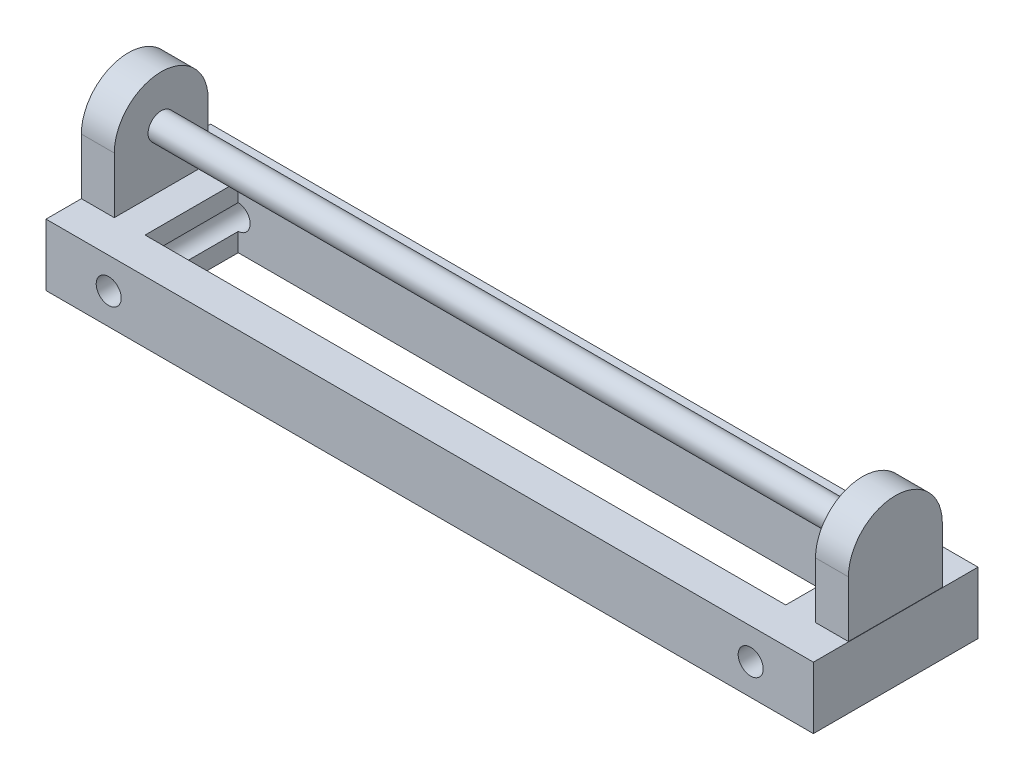
ISO-10303-21;
HEADER;
FILE_DESCRIPTION(('STEP AP214'),'2;1');
FILE_NAME('part.step','',(''),(''),'','','');
FILE_SCHEMA(('AUTOMOTIVE_DESIGN { 1 0 10303 214 1 1 1 1 }'));
ENDSEC;
DATA;
#1=APPLICATION_CONTEXT('core data for automotive mechanical design processes');
#2=APPLICATION_PROTOCOL_DEFINITION('international standard','automotive_design',2000,#1);
#3=PRODUCT_CONTEXT('',#1,'mechanical');
#4=PRODUCT('Part','Part','',(#3));
#5=PRODUCT_RELATED_PRODUCT_CATEGORY('part','',(#4));
#6=PRODUCT_DEFINITION_FORMATION('','',#4);
#7=PRODUCT_DEFINITION_CONTEXT('part definition',#1,'design');
#8=PRODUCT_DEFINITION('design','',#6,#7);
#9=PRODUCT_DEFINITION_SHAPE('','',#8);
#10=(LENGTH_UNIT() NAMED_UNIT(*) SI_UNIT(.MILLI.,.METRE.));
#11=(NAMED_UNIT(*) PLANE_ANGLE_UNIT() SI_UNIT($,.RADIAN.));
#12=(NAMED_UNIT(*) SI_UNIT($,.STERADIAN.) SOLID_ANGLE_UNIT());
#13=UNCERTAINTY_MEASURE_WITH_UNIT(LENGTH_MEASURE(1.E-05),#10,'distance_accuracy_value','');
#14=(GEOMETRIC_REPRESENTATION_CONTEXT(3) GLOBAL_UNCERTAINTY_ASSIGNED_CONTEXT((#13)) GLOBAL_UNIT_ASSIGNED_CONTEXT((#10,
#11,#12)) REPRESENTATION_CONTEXT('',''));
#15=CARTESIAN_POINT('',(0.,0.,0.));
#16=DIRECTION('',(0.,0.,1.));
#17=DIRECTION('',(1.,0.,0.));
#18=AXIS2_PLACEMENT_3D('',#15,#16,#17);
#19=CARTESIAN_POINT('',(0.,-0.612991157302917,50.));
#20=DIRECTION('',(0.,1.,0.));
#21=DIRECTION('',(0.,0.,1.));
#22=AXIS2_PLACEMENT_3D('',#19,#20,#21);
#23=PLANE('',#22);
#24=DIRECTION('',(1.,0.,0.));
#25=VECTOR('',#24,1.);
#26=CARTESIAN_POINT('',(-9.82732681158067,-0.612991157302914,10.8475881355509));
#27=LINE('',#26,#25);
#28=CARTESIAN_POINT('',(-9.82732681158067,-0.612991157302917,10.8475881355509));
#29=VERTEX_POINT('',#28);
#30=CARTESIAN_POINT('',(184.794211893689,-0.6129911573029,10.847588135551));
#31=VERTEX_POINT('',#30);
#32=EDGE_CURVE('E201',#29,#31,#27,.T.);
#33=ORIENTED_EDGE('',*,*,#32,.T.);
#34=DIRECTION('',(0.,0.,1.));
#35=VECTOR('',#34,1.);
#36=CARTESIAN_POINT('',(184.794211893689,-0.612991157302914,39.152411864449));
#37=LINE('',#36,#35);
#38=CARTESIAN_POINT('',(184.794211893689,-0.612991157302914,39.152411864449));
#39=VERTEX_POINT('',#38);
#40=EDGE_CURVE('E228',#31,#39,#37,.T.);
#41=ORIENTED_EDGE('',*,*,#40,.T.);
#42=DIRECTION('',(-1.,0.,0.));
#43=VECTOR('',#42,1.);
#44=CARTESIAN_POINT('',(-9.82732681158069,-0.612991157302914,39.152411864449));
#45=LINE('',#44,#43);
#46=CARTESIAN_POINT('',(-9.82732681158069,-0.612991157302914,39.152411864449));
#47=VERTEX_POINT('',#46);
#48=EDGE_CURVE('E210',#39,#47,#45,.T.);
#49=ORIENTED_EDGE('',*,*,#48,.T.);
#50=DIRECTION('',(0.,0.,-1.));
#51=VECTOR('',#50,1.);
#52=CARTESIAN_POINT('',(-9.82732681158069,-0.612991157302914,39.152411864449));
#53=LINE('',#52,#51);
#54=EDGE_CURVE('E206',#47,#29,#53,.T.);
#55=ORIENTED_EDGE('',*,*,#54,.T.);
#56=EDGE_LOOP('',(#33,#41,#49,#55));
#57=FACE_BOUND('',#56,.T.);
#58=DIRECTION('',(-1.,0.,0.));
#59=VECTOR('',#58,1.);
#60=CARTESIAN_POINT('',(-19.0662585842205,-0.612991157302956,10.7434951065919));
#61=LINE('',#60,#59);
#62=CARTESIAN_POINT('',(-19.0662585842205,-0.612991157302956,10.7434951065919));
#63=VERTEX_POINT('',#62);
#64=CARTESIAN_POINT('',(-29.0662585842205,-0.612991157302956,10.7434951065919));
#65=VERTEX_POINT('',#64);
#66=EDGE_CURVE('E297',#63,#65,#61,.T.);
#67=ORIENTED_EDGE('',*,*,#66,.F.);
#68=DIRECTION('',(0.,0.,1.));
#69=VECTOR('',#68,1.);
#70=CARTESIAN_POINT('',(-19.0662585842205,-0.612991157302952,39.2565048934081));
#71=LINE('',#70,#69);
#72=CARTESIAN_POINT('',(-19.0662585842205,-0.612991157302952,39.2565048934081));
#73=VERTEX_POINT('',#72);
#74=EDGE_CURVE('E278',#63,#73,#71,.T.);
#75=ORIENTED_EDGE('',*,*,#74,.T.);
#76=DIRECTION('',(-1.,0.,0.));
#77=VECTOR('',#76,1.);
#78=CARTESIAN_POINT('',(-19.0662585842205,-0.612991157302952,39.2565048934081));
#79=LINE('',#78,#77);
#80=CARTESIAN_POINT('',(-29.0662585842205,-0.612991157302917,39.2565048934081));
#81=VERTEX_POINT('',#80);
#82=EDGE_CURVE('E291',#73,#81,#79,.T.);
#83=ORIENTED_EDGE('',*,*,#82,.T.);
#84=DIRECTION('',(0.,0.,-1.));
#85=VECTOR('',#84,1.);
#86=CARTESIAN_POINT('',(-29.0662585842205,-0.612991157302917,50.));
#87=LINE('',#86,#85);
#88=CARTESIAN_POINT('',(-29.0662585842205,-0.612991157302917,50.));
#89=VERTEX_POINT('',#88);
#90=EDGE_CURVE('E43',#89,#81,#87,.T.);
#91=ORIENTED_EDGE('',*,*,#90,.F.);
#92=DIRECTION('',(1.,0.,0.));
#93=VECTOR('',#92,1.);
#94=CARTESIAN_POINT('',(0.,-0.612991157302917,50.));
#95=LINE('',#94,#93);
#96=CARTESIAN_POINT('',(204.033143666329,-0.612991157302917,50.));
#97=VERTEX_POINT('',#96);
#98=EDGE_CURVE('E364',#89,#97,#95,.T.);
#99=ORIENTED_EDGE('',*,*,#98,.T.);
#100=DIRECTION('',(0.,0.,-1.));
#101=VECTOR('',#100,1.);
#102=CARTESIAN_POINT('',(204.033143666329,-0.612991157302917,50.));
#103=LINE('',#102,#101);
#104=CARTESIAN_POINT('',(204.033143666329,-0.612991157302917,0.));
#105=VERTEX_POINT('',#104);
#106=EDGE_CURVE('E11',#97,#105,#103,.T.);
#107=ORIENTED_EDGE('',*,*,#106,.T.);
#108=DIRECTION('',(1.,0.,0.));
#109=VECTOR('',#108,1.);
#110=CARTESIAN_POINT('',(0.,-0.612991157302917,0.));
#111=LINE('',#110,#109);
#112=CARTESIAN_POINT('',(-29.0662585842205,-0.612991157302917,0.));
#113=VERTEX_POINT('',#112);
#114=EDGE_CURVE('E328',#113,#105,#111,.T.);
#115=ORIENTED_EDGE('',*,*,#114,.F.);
#116=EDGE_CURVE('E319',#65,#113,#87,.T.);
#117=ORIENTED_EDGE('',*,*,#116,.F.);
#118=EDGE_LOOP('',(#67,#75,#83,#91,#99,#107,#115,#117));
#119=FACE_BOUND('',#118,.T.);
#120=DIRECTION('',(0.,0.,1.));
#121=VECTOR('',#120,1.);
#122=CARTESIAN_POINT('',(203.93374141578,-0.612991157302952,39.2565048934081));
#123=LINE('',#122,#121);
#124=CARTESIAN_POINT('',(203.93374141578,-0.612991157302917,10.7434951065919));
#125=VERTEX_POINT('',#124);
#126=CARTESIAN_POINT('',(203.93374141578,-0.612991157302952,39.2565048934081));
#127=VERTEX_POINT('',#126);
#128=EDGE_CURVE('E246',#125,#127,#123,.T.);
#129=ORIENTED_EDGE('',*,*,#128,.T.);
#130=DIRECTION('',(1.,0.,0.));
#131=VECTOR('',#130,1.);
#132=CARTESIAN_POINT('',(193.93374141578,-0.612991157302952,39.2565048934081));
#133=LINE('',#132,#131);
#134=CARTESIAN_POINT('',(193.93374141578,-0.612991157302952,39.2565048934081));
#135=VERTEX_POINT('',#134);
#136=EDGE_CURVE('E274',#135,#127,#133,.T.);
#137=ORIENTED_EDGE('',*,*,#136,.F.);
#138=DIRECTION('',(0.,0.,1.));
#139=VECTOR('',#138,1.);
#140=CARTESIAN_POINT('',(193.93374141578,-0.612991157302952,39.2565048934081));
#141=LINE('',#140,#139);
#142=CARTESIAN_POINT('',(193.93374141578,-0.612991157302956,10.7434951065919));
#143=VERTEX_POINT('',#142);
#144=EDGE_CURVE('E247',#143,#135,#141,.T.);
#145=ORIENTED_EDGE('',*,*,#144,.F.);
#146=DIRECTION('',(1.,0.,0.));
#147=VECTOR('',#146,1.);
#148=CARTESIAN_POINT('',(193.93374141578,-0.612991157302956,10.7434951065919));
#149=LINE('',#148,#147);
#150=EDGE_CURVE('E257',#143,#125,#149,.T.);
#151=ORIENTED_EDGE('',*,*,#150,.T.);
#152=EDGE_LOOP('',(#129,#137,#145,#151));
#153=FACE_BOUND('',#152,.T.);
#154=ADVANCED_FACE('F34',(#57,#119,#153),#23,.T.);
#155=CARTESIAN_POINT('',(204.033143666329,0.,50.));
#156=DIRECTION('',(1.,0.,0.));
#157=DIRECTION('',(0.,0.,-1.));
#158=AXIS2_PLACEMENT_3D('',#155,#156,#157);
#159=PLANE('',#158);
#160=DIRECTION('',(0.,-1.,0.));
#161=VECTOR('',#160,1.);
#162=CARTESIAN_POINT('',(204.033143666329,0.,0.));
#163=LINE('',#162,#161);
#164=CARTESIAN_POINT('',(204.033143666329,-19.4201237605884,0.));
#165=VERTEX_POINT('',#164);
#166=EDGE_CURVE('E351',#105,#165,#163,.T.);
#167=ORIENTED_EDGE('',*,*,#166,.F.);
#168=ORIENTED_EDGE('',*,*,#106,.F.);
#169=DIRECTION('',(0.,-1.,0.));
#170=VECTOR('',#169,1.);
#171=CARTESIAN_POINT('',(204.033143666329,0.,50.));
#172=LINE('',#171,#170);
#173=CARTESIAN_POINT('',(204.033143666329,-19.4201237605884,50.));
#174=VERTEX_POINT('',#173);
#175=EDGE_CURVE('E366',#97,#174,#172,.T.);
#176=ORIENTED_EDGE('',*,*,#175,.T.);
#177=DIRECTION('',(0.,0.,-1.));
#178=VECTOR('',#177,1.);
#179=CARTESIAN_POINT('',(204.033143666329,-19.4201237605884,50.));
#180=LINE('',#179,#178);
#181=EDGE_CURVE('E334',#174,#165,#180,.T.);
#182=ORIENTED_EDGE('',*,*,#181,.T.);
#183=EDGE_LOOP('',(#167,#168,#176,#182));
#184=FACE_BOUND('',#183,.T.);
#185=ADVANCED_FACE('F400',(#184),#159,.T.);
#186=CARTESIAN_POINT('',(-29.0662585842205,0.,50.));
#187=DIRECTION('',(-1.,0.,0.));
#188=DIRECTION('',(0.,0.,1.));
#189=AXIS2_PLACEMENT_3D('',#186,#187,#188);
#190=PLANE('',#189);
#191=DIRECTION('',(0.,1.,0.));
#192=VECTOR('',#191,1.);
#193=CARTESIAN_POINT('',(-29.0662585842205,0.,0.));
#194=LINE('',#193,#192);
#195=CARTESIAN_POINT('',(-29.0662585842205,-19.4201237605884,0.));
#196=VERTEX_POINT('',#195);
#197=EDGE_CURVE('E348',#196,#113,#194,.T.);
#198=ORIENTED_EDGE('',*,*,#197,.F.);
#199=DIRECTION('',(0.,0.,-1.));
#200=VECTOR('',#199,1.);
#201=CARTESIAN_POINT('',(-29.0662585842205,-19.4201237605884,50.));
#202=LINE('',#201,#200);
#203=CARTESIAN_POINT('',(-29.0662585842205,-19.4201237605884,50.));
#204=VERTEX_POINT('',#203);
#205=EDGE_CURVE('E330',#204,#196,#202,.T.);
#206=ORIENTED_EDGE('',*,*,#205,.F.);
#207=DIRECTION('',(0.,1.,0.));
#208=VECTOR('',#207,1.);
#209=CARTESIAN_POINT('',(-29.0662585842205,0.,50.));
#210=LINE('',#209,#208);
#211=EDGE_CURVE('E361',#204,#89,#210,.T.);
#212=ORIENTED_EDGE('',*,*,#211,.T.);
#213=ORIENTED_EDGE('',*,*,#90,.T.);
#214=DIRECTION('',(0.,1.,0.));
#215=VECTOR('',#214,1.);
#216=CARTESIAN_POINT('',(-29.0662585842205,16.3931982769044,39.2565048934081));
#217=LINE('',#216,#215);
#218=CARTESIAN_POINT('',(-29.0662585842205,16.3931982769044,39.2565048934081));
#219=VERTEX_POINT('',#218);
#220=EDGE_CURVE('E277',#81,#219,#217,.T.);
#221=ORIENTED_EDGE('',*,*,#220,.T.);
#222=CARTESIAN_POINT('',(-29.0662585842205,16.3931982769044,25.));
#223=DIRECTION('',(-1.,0.,0.));
#224=DIRECTION('',(0.,0.,-1.));
#225=AXIS2_PLACEMENT_3D('',#222,#223,#224);
#226=CIRCLE('',#225,14.2565048934081);
#227=CARTESIAN_POINT('',(-29.0662585842205,16.3931982769044,10.7434951065919));
#228=VERTEX_POINT('',#227);
#229=EDGE_CURVE('E292',#219,#228,#226,.T.);
#230=ORIENTED_EDGE('',*,*,#229,.T.);
#231=DIRECTION('',(0.,-1.,0.));
#232=VECTOR('',#231,1.);
#233=CARTESIAN_POINT('',(-29.0662585842205,-0.612991157302956,10.7434951065919));
#234=LINE('',#233,#232);
#235=EDGE_CURVE('E282',#228,#65,#234,.T.);
#236=ORIENTED_EDGE('',*,*,#235,.T.);
#237=ORIENTED_EDGE('',*,*,#116,.T.);
#238=EDGE_LOOP('',(#198,#206,#212,#213,#221,#230,#236,#237));
#239=FACE_BOUND('',#238,.T.);
#240=ADVANCED_FACE('F318',(#239),#190,.T.);
#241=CARTESIAN_POINT('',(0.,-19.4201237605884,50.));
#242=DIRECTION('',(0.,-1.,0.));
#243=DIRECTION('',(0.,0.,-1.));
#244=AXIS2_PLACEMENT_3D('',#241,#242,#243);
#245=PLANE('',#244);
#246=DIRECTION('',(1.,0.,0.));
#247=VECTOR('',#246,1.);
#248=CARTESIAN_POINT('',(-9.82732681158067,-19.4201237605884,10.8475881355509));
#249=LINE('',#248,#247);
#250=CARTESIAN_POINT('',(-9.82732681158067,-19.4201237605884,10.8475881355509));
#251=VERTEX_POINT('',#250);
#252=CARTESIAN_POINT('',(184.794211893689,-19.4201237605884,10.847588135551));
#253=VERTEX_POINT('',#252);
#254=EDGE_CURVE('E191',#251,#253,#249,.T.);
#255=ORIENTED_EDGE('',*,*,#254,.F.);
#256=DIRECTION('',(0.,0.,-1.));
#257=VECTOR('',#256,1.);
#258=CARTESIAN_POINT('',(-9.82732681158069,-19.4201237605884,39.152411864449));
#259=LINE('',#258,#257);
#260=CARTESIAN_POINT('',(-9.82732681158069,-19.4201237605884,39.152411864449));
#261=VERTEX_POINT('',#260);
#262=EDGE_CURVE('E221',#261,#251,#259,.T.);
#263=ORIENTED_EDGE('',*,*,#262,.F.);
#264=DIRECTION('',(-1.,0.,0.));
#265=VECTOR('',#264,1.);
#266=CARTESIAN_POINT('',(-9.82732681158069,-19.4201237605884,39.152411864449));
#267=LINE('',#266,#265);
#268=CARTESIAN_POINT('',(184.794211893689,-19.4201237605884,39.152411864449));
#269=VERTEX_POINT('',#268);
#270=EDGE_CURVE('E59',#269,#261,#267,.T.);
#271=ORIENTED_EDGE('',*,*,#270,.F.);
#272=DIRECTION('',(0.,0.,1.));
#273=VECTOR('',#272,1.);
#274=CARTESIAN_POINT('',(184.794211893689,-19.4201237605884,39.152411864449));
#275=LINE('',#274,#273);
#276=EDGE_CURVE('E218',#253,#269,#275,.T.);
#277=ORIENTED_EDGE('',*,*,#276,.F.);
#278=EDGE_LOOP('',(#255,#263,#271,#277));
#279=FACE_BOUND('',#278,.T.);
#280=DIRECTION('',(-1.,0.,0.));
#281=VECTOR('',#280,1.);
#282=CARTESIAN_POINT('',(0.,-19.4201237605884,0.));
#283=LINE('',#282,#281);
#284=EDGE_CURVE('E345',#165,#196,#283,.T.);
#285=ORIENTED_EDGE('',*,*,#284,.F.);
#286=ORIENTED_EDGE('',*,*,#181,.F.);
#287=DIRECTION('',(-1.,0.,0.));
#288=VECTOR('',#287,1.);
#289=CARTESIAN_POINT('',(0.,-19.4201237605884,50.));
#290=LINE('',#289,#288);
#291=EDGE_CURVE('E358',#174,#204,#290,.T.);
#292=ORIENTED_EDGE('',*,*,#291,.T.);
#293=ORIENTED_EDGE('',*,*,#205,.T.);
#294=EDGE_LOOP('',(#285,#286,#292,#293));
#295=FACE_BOUND('',#294,.T.);
#296=ADVANCED_FACE('F410',(#279,#295),#245,.T.);
#297=CARTESIAN_POINT('',(-10.0165574589457,-10.0165574589457,50.));
#298=DIRECTION('',(0.,0.,-1.));
#299=DIRECTION('',(-1.,0.,0.));
#300=AXIS2_PLACEMENT_3D('',#297,#298,#299);
#301=CYLINDRICAL_SURFACE('',#300,3.79708670005155);
#302=DIRECTION('',(0.,0.,-1.));
#303=VECTOR('',#302,1.);
#304=CARTESIAN_POINT('',(-9.82732681158069,-13.8089260024559,50.));
#305=LINE('',#304,#303);
#306=CARTESIAN_POINT('',(-9.82732681158069,-13.8089260024559,39.152411864449));
#307=VERTEX_POINT('',#306);
#308=CARTESIAN_POINT('',(-9.82732681158067,-13.8089260024559,10.8475881355509));
#309=VERTEX_POINT('',#308);
#310=EDGE_CURVE('E207',#307,#309,#305,.T.);
#311=ORIENTED_EDGE('',*,*,#310,.T.);
#312=CARTESIAN_POINT('',(-10.0165574589457,-10.0165574589457,10.8475881355509));
#313=DIRECTION('',(0.,0.,-1.));
#314=DIRECTION('',(-1.,0.,0.));
#315=AXIS2_PLACEMENT_3D('',#312,#313,#314);
#316=CIRCLE('',#315,3.79708670005155);
#317=CARTESIAN_POINT('',(-9.82732681158067,-6.22418891543541,10.8475881355509));
#318=VERTEX_POINT('',#317);
#319=EDGE_CURVE('E193',#309,#318,#316,.F.);
#320=ORIENTED_EDGE('',*,*,#319,.T.);
#321=DIRECTION('',(0.,0.,-1.));
#322=VECTOR('',#321,1.);
#323=CARTESIAN_POINT('',(-9.82732681158069,-6.22418891543541,50.));
#324=LINE('',#323,#322);
#325=CARTESIAN_POINT('',(-9.82732681158069,-6.22418891543541,39.152411864449));
#326=VERTEX_POINT('',#325);
#327=EDGE_CURVE('E233',#318,#326,#324,.F.);
#328=ORIENTED_EDGE('',*,*,#327,.T.);
#329=CARTESIAN_POINT('',(-10.0165574589457,-10.0165574589457,39.152411864449));
#330=DIRECTION('',(0.,0.,1.));
#331=DIRECTION('',(1.,0.,0.));
#332=AXIS2_PLACEMENT_3D('',#329,#330,#331);
#333=CIRCLE('',#332,3.79708670005155);
#334=EDGE_CURVE('E215',#326,#307,#333,.F.);
#335=ORIENTED_EDGE('',*,*,#334,.T.);
#336=EDGE_LOOP('',(#311,#320,#328,#335));
#337=FACE_BOUND('',#336,.T.);
#338=CARTESIAN_POINT('',(-10.0165574589457,-10.0165574589457,50.));
#339=DIRECTION('',(0.,0.,1.));
#340=DIRECTION('',(1.,0.,0.));
#341=AXIS2_PLACEMENT_3D('',#338,#339,#340);
#342=CIRCLE('',#341,3.79708670005155);
#343=CARTESIAN_POINT('',(-6.21947075889412,-10.0165574589457,50.));
#344=VERTEX_POINT('',#343);
#345=EDGE_CURVE('E302',#344,#344,#342,.T.);
#346=ORIENTED_EDGE('',*,*,#345,.T.);
#347=EDGE_LOOP('',(#346));
#348=FACE_BOUND('',#347,.T.);
#349=CARTESIAN_POINT('',(-10.0165574589457,-10.0165574589457,0.));
#350=DIRECTION('',(0.,0.,1.));
#351=DIRECTION('',(1.,0.,0.));
#352=AXIS2_PLACEMENT_3D('',#349,#350,#351);
#353=CIRCLE('',#352,3.79708670005155);
#354=CARTESIAN_POINT('',(-6.21947075889412,-10.0165574589457,0.));
#355=VERTEX_POINT('',#354);
#356=EDGE_CURVE('E311',#355,#355,#353,.T.);
#357=ORIENTED_EDGE('',*,*,#356,.F.);
#358=EDGE_LOOP('',(#357));
#359=FACE_BOUND('',#358,.T.);
#360=ADVANCED_FACE('F36',(#337,#348,#359),#301,.F.);
#361=CARTESIAN_POINT('',(184.983442541054,-10.0165574589457,50.));
#362=DIRECTION('',(0.,0.,-1.));
#363=DIRECTION('',(-1.,0.,0.));
#364=AXIS2_PLACEMENT_3D('',#361,#362,#363);
#365=CYLINDRICAL_SURFACE('',#364,3.79708670005154);
#366=CARTESIAN_POINT('',(184.983442541054,-10.0165574589457,10.847588135551));
#367=DIRECTION('',(0.,0.,-1.));
#368=DIRECTION('',(-1.,0.,0.));
#369=AXIS2_PLACEMENT_3D('',#366,#367,#368);
#370=CIRCLE('',#369,3.79708670005154);
#371=CARTESIAN_POINT('',(184.794211893689,-6.22418891543541,10.847588135551));
#372=VERTEX_POINT('',#371);
#373=CARTESIAN_POINT('',(184.794211893689,-13.8089260024559,10.847588135551));
#374=VERTEX_POINT('',#373);
#375=EDGE_CURVE('E188',#372,#374,#370,.F.);
#376=ORIENTED_EDGE('',*,*,#375,.T.);
#377=DIRECTION('',(0.,0.,-1.));
#378=VECTOR('',#377,1.);
#379=CARTESIAN_POINT('',(184.794211893689,-13.8089260024559,50.));
#380=LINE('',#379,#378);
#381=CARTESIAN_POINT('',(184.794211893689,-13.8089260024559,39.152411864449));
#382=VERTEX_POINT('',#381);
#383=EDGE_CURVE('E173',#374,#382,#380,.F.);
#384=ORIENTED_EDGE('',*,*,#383,.T.);
#385=CARTESIAN_POINT('',(184.983442541054,-10.0165574589457,39.152411864449));
#386=DIRECTION('',(0.,0.,1.));
#387=DIRECTION('',(1.,0.,0.));
#388=AXIS2_PLACEMENT_3D('',#385,#386,#387);
#389=CIRCLE('',#388,3.79708670005154);
#390=CARTESIAN_POINT('',(184.794211893689,-6.22418891543541,39.152411864449));
#391=VERTEX_POINT('',#390);
#392=EDGE_CURVE('E214',#382,#391,#389,.F.);
#393=ORIENTED_EDGE('',*,*,#392,.T.);
#394=DIRECTION('',(0.,0.,-1.));
#395=VECTOR('',#394,1.);
#396=CARTESIAN_POINT('',(184.794211893689,-6.22418891543541,50.));
#397=LINE('',#396,#395);
#398=EDGE_CURVE('E183',#391,#372,#397,.T.);
#399=ORIENTED_EDGE('',*,*,#398,.T.);
#400=EDGE_LOOP('',(#376,#384,#393,#399));
#401=FACE_BOUND('',#400,.T.);
#402=CARTESIAN_POINT('',(184.983442541054,-10.0165574589457,50.));
#403=DIRECTION('',(0.,0.,1.));
#404=DIRECTION('',(1.,0.,0.));
#405=AXIS2_PLACEMENT_3D('',#402,#403,#404);
#406=CIRCLE('',#405,3.79708670005154);
#407=CARTESIAN_POINT('',(188.780529241106,-10.0165574589457,50.));
#408=VERTEX_POINT('',#407);
#409=EDGE_CURVE('E341',#408,#408,#406,.T.);
#410=ORIENTED_EDGE('',*,*,#409,.T.);
#411=EDGE_LOOP('',(#410));
#412=FACE_BOUND('',#411,.T.);
#413=CARTESIAN_POINT('',(184.983442541054,-10.0165574589457,0.));
#414=DIRECTION('',(0.,0.,1.));
#415=DIRECTION('',(1.,0.,0.));
#416=AXIS2_PLACEMENT_3D('',#413,#414,#415);
#417=CIRCLE('',#416,3.79708670005154);
#418=CARTESIAN_POINT('',(188.780529241106,-10.0165574589457,0.));
#419=VERTEX_POINT('',#418);
#420=EDGE_CURVE('E342',#419,#419,#417,.T.);
#421=ORIENTED_EDGE('',*,*,#420,.F.);
#422=EDGE_LOOP('',(#421));
#423=FACE_BOUND('',#422,.T.);
#424=ADVANCED_FACE('F197',(#401,#412,#423),#365,.F.);
#425=CARTESIAN_POINT('',(0.,0.,50.));
#426=DIRECTION('',(0.,0.,1.));
#427=DIRECTION('',(1.,0.,0.));
#428=AXIS2_PLACEMENT_3D('',#425,#426,#427);
#429=PLANE('',#428);
#430=ORIENTED_EDGE('',*,*,#345,.F.);
#431=EDGE_LOOP('',(#430));
#432=FACE_BOUND('',#431,.T.);
#433=ORIENTED_EDGE('',*,*,#175,.F.);
#434=ORIENTED_EDGE('',*,*,#98,.F.);
#435=ORIENTED_EDGE('',*,*,#211,.F.);
#436=ORIENTED_EDGE('',*,*,#291,.F.);
#437=EDGE_LOOP('',(#433,#434,#435,#436));
#438=FACE_BOUND('',#437,.T.);
#439=ORIENTED_EDGE('',*,*,#409,.F.);
#440=EDGE_LOOP('',(#439));
#441=FACE_BOUND('',#440,.T.);
#442=ADVANCED_FACE('F376',(#432,#438,#441),#429,.T.);
#443=CARTESIAN_POINT('',(0.,0.,0.));
#444=DIRECTION('',(0.,0.,1.));
#445=DIRECTION('',(1.,0.,0.));
#446=AXIS2_PLACEMENT_3D('',#443,#444,#445);
#447=PLANE('',#446);
#448=ORIENTED_EDGE('',*,*,#356,.T.);
#449=EDGE_LOOP('',(#448));
#450=FACE_BOUND('',#449,.T.);
#451=ORIENTED_EDGE('',*,*,#166,.T.);
#452=ORIENTED_EDGE('',*,*,#284,.T.);
#453=ORIENTED_EDGE('',*,*,#197,.T.);
#454=ORIENTED_EDGE('',*,*,#114,.T.);
#455=EDGE_LOOP('',(#451,#452,#453,#454));
#456=FACE_BOUND('',#455,.T.);
#457=ORIENTED_EDGE('',*,*,#420,.T.);
#458=EDGE_LOOP('',(#457));
#459=FACE_BOUND('',#458,.T.);
#460=ADVANCED_FACE('F379',(#450,#456,#459),#447,.F.);
#461=CARTESIAN_POINT('',(-19.0662585842205,-0.612991157302956,10.7434951065919));
#462=DIRECTION('',(0.,0.,-1.));
#463=DIRECTION('',(0.,1.,0.));
#464=AXIS2_PLACEMENT_3D('',#461,#462,#463);
#465=PLANE('',#464);
#466=ORIENTED_EDGE('',*,*,#235,.F.);
#467=DIRECTION('',(-1.,0.,0.));
#468=VECTOR('',#467,1.);
#469=CARTESIAN_POINT('',(-19.0662585842205,16.3931982769044,10.7434951065919));
#470=LINE('',#469,#468);
#471=CARTESIAN_POINT('',(-19.0662585842205,16.3931982769044,10.7434951065919));
#472=VERTEX_POINT('',#471);
#473=EDGE_CURVE('E295',#472,#228,#470,.T.);
#474=ORIENTED_EDGE('',*,*,#473,.F.);
#475=DIRECTION('',(0.,-1.,0.));
#476=VECTOR('',#475,1.);
#477=CARTESIAN_POINT('',(-19.0662585842205,-0.612991157302956,10.7434951065919));
#478=LINE('',#477,#476);
#479=EDGE_CURVE('E288',#472,#63,#478,.T.);
#480=ORIENTED_EDGE('',*,*,#479,.T.);
#481=ORIENTED_EDGE('',*,*,#66,.T.);
#482=EDGE_LOOP('',(#466,#474,#480,#481));
#483=FACE_BOUND('',#482,.T.);
#484=ADVANCED_FACE('F390',(#483),#465,.T.);
#485=CARTESIAN_POINT('',(-19.0662585842205,16.3931982769044,25.));
#486=DIRECTION('',(-1.,0.,0.));
#487=DIRECTION('',(0.,0.,1.));
#488=AXIS2_PLACEMENT_3D('',#485,#486,#487);
#489=CYLINDRICAL_SURFACE('',#488,14.2565048934081);
#490=ORIENTED_EDGE('',*,*,#229,.F.);
#491=DIRECTION('',(-1.,0.,0.));
#492=VECTOR('',#491,1.);
#493=CARTESIAN_POINT('',(-19.0662585842205,16.3931982769044,39.2565048934081));
#494=LINE('',#493,#492);
#495=CARTESIAN_POINT('',(-19.0662585842205,16.3931982769044,39.2565048934081));
#496=VERTEX_POINT('',#495);
#497=EDGE_CURVE('E298',#496,#219,#494,.T.);
#498=ORIENTED_EDGE('',*,*,#497,.F.);
#499=CARTESIAN_POINT('',(-19.0662585842205,16.3931982769044,25.));
#500=DIRECTION('',(-1.,0.,0.));
#501=DIRECTION('',(0.,0.,-1.));
#502=AXIS2_PLACEMENT_3D('',#499,#500,#501);
#503=CIRCLE('',#502,14.2565048934081);
#504=EDGE_CURVE('E285',#496,#472,#503,.T.);
#505=ORIENTED_EDGE('',*,*,#504,.T.);
#506=ORIENTED_EDGE('',*,*,#473,.T.);
#507=EDGE_LOOP('',(#490,#498,#505,#506));
#508=FACE_BOUND('',#507,.T.);
#509=ADVANCED_FACE('F396',(#508),#489,.T.);
#510=CARTESIAN_POINT('',(-19.0662585842205,16.3931982769044,39.2565048934081));
#511=DIRECTION('',(0.,0.,1.));
#512=DIRECTION('',(1.,0.,0.));
#513=AXIS2_PLACEMENT_3D('',#510,#511,#512);
#514=PLANE('',#513);
#515=ORIENTED_EDGE('',*,*,#220,.F.);
#516=ORIENTED_EDGE('',*,*,#82,.F.);
#517=DIRECTION('',(0.,1.,0.));
#518=VECTOR('',#517,1.);
#519=CARTESIAN_POINT('',(-19.0662585842205,16.3931982769044,39.2565048934081));
#520=LINE('',#519,#518);
#521=EDGE_CURVE('E281',#73,#496,#520,.T.);
#522=ORIENTED_EDGE('',*,*,#521,.T.);
#523=ORIENTED_EDGE('',*,*,#497,.T.);
#524=EDGE_LOOP('',(#515,#516,#522,#523));
#525=FACE_BOUND('',#524,.T.);
#526=ADVANCED_FACE('F423',(#525),#514,.T.);
#527=CARTESIAN_POINT('',(-19.0662585842205,16.3931982769044,25.));
#528=DIRECTION('',(1.,0.,0.));
#529=DIRECTION('',(0.,0.,-1.));
#530=AXIS2_PLACEMENT_3D('',#527,#528,#529);
#531=PLANE('',#530);
#532=CARTESIAN_POINT('',(-19.0662585842205,16.3931982769044,25.));
#533=DIRECTION('',(1.,0.,0.));
#534=DIRECTION('',(0.,0.,-1.));
#535=AXIS2_PLACEMENT_3D('',#532,#533,#534);
#536=CIRCLE('',#535,4.00110175958003);
#537=CARTESIAN_POINT('',(-19.0662585842205,16.3931982769044,20.99889824042));
#538=VERTEX_POINT('',#537);
#539=EDGE_CURVE('E236',#538,#538,#536,.T.);
#540=ORIENTED_EDGE('',*,*,#539,.F.);
#541=EDGE_LOOP('',(#540));
#542=FACE_BOUND('',#541,.T.);
#543=ORIENTED_EDGE('',*,*,#74,.F.);
#544=ORIENTED_EDGE('',*,*,#479,.F.);
#545=ORIENTED_EDGE('',*,*,#504,.F.);
#546=ORIENTED_EDGE('',*,*,#521,.F.);
#547=EDGE_LOOP('',(#543,#544,#545,#546));
#548=FACE_BOUND('',#547,.T.);
#549=ADVANCED_FACE('F427',(#542,#548),#531,.T.);
#550=CARTESIAN_POINT('',(193.93374141578,16.3931982769044,25.));
#551=DIRECTION('',(1.,0.,0.));
#552=DIRECTION('',(0.,0.,-1.));
#553=AXIS2_PLACEMENT_3D('',#550,#551,#552);
#554=PLANE('',#553);
#555=ORIENTED_EDGE('',*,*,#144,.T.);
#556=DIRECTION('',(0.,1.,0.));
#557=VECTOR('',#556,1.);
#558=CARTESIAN_POINT('',(193.93374141578,16.3931982769044,39.2565048934081));
#559=LINE('',#558,#557);
#560=CARTESIAN_POINT('',(193.93374141578,16.3931982769044,39.2565048934081));
#561=VERTEX_POINT('',#560);
#562=EDGE_CURVE('E250',#135,#561,#559,.T.);
#563=ORIENTED_EDGE('',*,*,#562,.T.);
#564=CARTESIAN_POINT('',(193.93374141578,16.3931982769044,25.));
#565=DIRECTION('',(-1.,0.,0.));
#566=DIRECTION('',(0.,0.,-1.));
#567=AXIS2_PLACEMENT_3D('',#564,#565,#566);
#568=CIRCLE('',#567,14.2565048934081);
#569=CARTESIAN_POINT('',(193.93374141578,16.3931982769044,10.7434951065919));
#570=VERTEX_POINT('',#569);
#571=EDGE_CURVE('E253',#561,#570,#568,.T.);
#572=ORIENTED_EDGE('',*,*,#571,.T.);
#573=DIRECTION('',(0.,-1.,0.));
#574=VECTOR('',#573,1.);
#575=CARTESIAN_POINT('',(193.93374141578,-0.612991157302956,10.7434951065919));
#576=LINE('',#575,#574);
#577=EDGE_CURVE('E255',#570,#143,#576,.T.);
#578=ORIENTED_EDGE('',*,*,#577,.T.);
#579=EDGE_LOOP('',(#555,#563,#572,#578));
#580=FACE_BOUND('',#579,.T.);
#581=CARTESIAN_POINT('',(193.93374141578,16.3931982769044,25.));
#582=DIRECTION('',(-1.,0.,0.));
#583=DIRECTION('',(0.,0.,1.));
#584=AXIS2_PLACEMENT_3D('',#581,#582,#583);
#585=CIRCLE('',#584,4.00110175958003);
#586=CARTESIAN_POINT('',(193.93374141578,16.3931982769044,29.00110175958));
#587=VERTEX_POINT('',#586);
#588=EDGE_CURVE('E243',#587,#587,#585,.T.);
#589=ORIENTED_EDGE('',*,*,#588,.F.);
#590=EDGE_LOOP('',(#589));
#591=FACE_BOUND('',#590,.T.);
#592=ADVANCED_FACE('F439',(#580,#591),#554,.F.);
#593=CARTESIAN_POINT('',(203.93374141578,16.3931982769044,25.));
#594=DIRECTION('',(1.,0.,0.));
#595=DIRECTION('',(0.,0.,-1.));
#596=AXIS2_PLACEMENT_3D('',#593,#594,#595);
#597=PLANE('',#596);
#598=ORIENTED_EDGE('',*,*,#128,.F.);
#599=DIRECTION('',(0.,-1.,0.));
#600=VECTOR('',#599,1.);
#601=CARTESIAN_POINT('',(203.93374141578,-0.612991157302956,10.7434951065919));
#602=LINE('',#601,#600);
#603=CARTESIAN_POINT('',(203.93374141578,16.3931982769044,10.7434951065919));
#604=VERTEX_POINT('',#603);
#605=EDGE_CURVE('E251',#604,#125,#602,.T.);
#606=ORIENTED_EDGE('',*,*,#605,.F.);
#607=CARTESIAN_POINT('',(203.93374141578,16.3931982769044,25.));
#608=DIRECTION('',(-1.,0.,0.));
#609=DIRECTION('',(0.,0.,-1.));
#610=AXIS2_PLACEMENT_3D('',#607,#608,#609);
#611=CIRCLE('',#610,14.2565048934081);
#612=CARTESIAN_POINT('',(203.93374141578,16.3931982769044,39.2565048934081));
#613=VERTEX_POINT('',#612);
#614=EDGE_CURVE('E262',#613,#604,#611,.T.);
#615=ORIENTED_EDGE('',*,*,#614,.F.);
#616=DIRECTION('',(0.,1.,0.));
#617=VECTOR('',#616,1.);
#618=CARTESIAN_POINT('',(203.93374141578,16.3931982769044,39.2565048934081));
#619=LINE('',#618,#617);
#620=EDGE_CURVE('E260',#127,#613,#619,.T.);
#621=ORIENTED_EDGE('',*,*,#620,.F.);
#622=EDGE_LOOP('',(#598,#606,#615,#621));
#623=FACE_BOUND('',#622,.T.);
#624=ADVANCED_FACE('F445',(#623),#597,.T.);
#625=CARTESIAN_POINT('',(193.93374141578,16.3931982769044,39.2565048934081));
#626=DIRECTION('',(0.,0.,-1.));
#627=DIRECTION('',(-1.,0.,0.));
#628=AXIS2_PLACEMENT_3D('',#625,#626,#627);
#629=PLANE('',#628);
#630=ORIENTED_EDGE('',*,*,#620,.T.);
#631=DIRECTION('',(1.,0.,0.));
#632=VECTOR('',#631,1.);
#633=CARTESIAN_POINT('',(193.93374141578,16.3931982769044,39.2565048934081));
#634=LINE('',#633,#632);
#635=EDGE_CURVE('E271',#561,#613,#634,.T.);
#636=ORIENTED_EDGE('',*,*,#635,.F.);
#637=ORIENTED_EDGE('',*,*,#562,.F.);
#638=ORIENTED_EDGE('',*,*,#136,.T.);
#639=EDGE_LOOP('',(#630,#636,#637,#638));
#640=FACE_BOUND('',#639,.T.);
#641=ADVANCED_FACE('F441',(#640),#629,.F.);
#642=CARTESIAN_POINT('',(193.93374141578,16.3931982769044,25.));
#643=DIRECTION('',(1.,0.,0.));
#644=DIRECTION('',(0.,0.,-1.));
#645=AXIS2_PLACEMENT_3D('',#642,#643,#644);
#646=CYLINDRICAL_SURFACE('',#645,14.2565048934081);
#647=ORIENTED_EDGE('',*,*,#614,.T.);
#648=DIRECTION('',(1.,0.,0.));
#649=VECTOR('',#648,1.);
#650=CARTESIAN_POINT('',(193.93374141578,16.3931982769044,10.7434951065919));
#651=LINE('',#650,#649);
#652=EDGE_CURVE('E268',#570,#604,#651,.T.);
#653=ORIENTED_EDGE('',*,*,#652,.F.);
#654=ORIENTED_EDGE('',*,*,#571,.F.);
#655=ORIENTED_EDGE('',*,*,#635,.T.);
#656=EDGE_LOOP('',(#647,#653,#654,#655));
#657=FACE_BOUND('',#656,.T.);
#658=ADVANCED_FACE('F444',(#657),#646,.T.);
#659=CARTESIAN_POINT('',(193.93374141578,-0.612991157302956,10.7434951065919));
#660=DIRECTION('',(0.,0.,1.));
#661=DIRECTION('',(0.,-1.,0.));
#662=AXIS2_PLACEMENT_3D('',#659,#660,#661);
#663=PLANE('',#662);
#664=ORIENTED_EDGE('',*,*,#605,.T.);
#665=ORIENTED_EDGE('',*,*,#150,.F.);
#666=ORIENTED_EDGE('',*,*,#577,.F.);
#667=ORIENTED_EDGE('',*,*,#652,.T.);
#668=EDGE_LOOP('',(#664,#665,#666,#667));
#669=FACE_BOUND('',#668,.T.);
#670=ADVANCED_FACE('F449',(#669),#663,.F.);
#671=CARTESIAN_POINT('',(-29.0662585842205,16.3931982769044,25.));
#672=DIRECTION('',(1.,0.,0.));
#673=DIRECTION('',(0.,0.,-1.));
#674=AXIS2_PLACEMENT_3D('',#671,#672,#673);
#675=CYLINDRICAL_SURFACE('',#674,4.00110175958003);
#676=ORIENTED_EDGE('',*,*,#539,.T.);
#677=EDGE_LOOP('',(#676));
#678=FACE_BOUND('',#677,.T.);
#679=ORIENTED_EDGE('',*,*,#588,.T.);
#680=EDGE_LOOP('',(#679));
#681=FACE_BOUND('',#680,.T.);
#682=ADVANCED_FACE('F453',(#678,#681),#675,.T.);
#683=CARTESIAN_POINT('',(-9.82732681158067,30.6507031703125,10.8475881355509));
#684=DIRECTION('',(0.,0.,-1.));
#685=DIRECTION('',(-1.,0.,0.));
#686=AXIS2_PLACEMENT_3D('',#683,#684,#685);
#687=PLANE('',#686);
#688=DIRECTION('',(0.,-1.,0.));
#689=VECTOR('',#688,1.);
#690=CARTESIAN_POINT('',(-9.82732681158067,30.6507031703125,10.8475881355509));
#691=LINE('',#690,#689);
#692=EDGE_CURVE('E51',#29,#318,#691,.T.);
#693=ORIENTED_EDGE('',*,*,#692,.T.);
#694=ORIENTED_EDGE('',*,*,#319,.F.);
#695=EDGE_CURVE('E205',#309,#251,#691,.T.);
#696=ORIENTED_EDGE('',*,*,#695,.T.);
#697=ORIENTED_EDGE('',*,*,#254,.T.);
#698=DIRECTION('',(0.,-1.,0.));
#699=VECTOR('',#698,1.);
#700=CARTESIAN_POINT('',(184.794211893689,30.6507031703125,10.847588135551));
#701=LINE('',#700,#699);
#702=EDGE_CURVE('E177',#374,#253,#701,.T.);
#703=ORIENTED_EDGE('',*,*,#702,.F.);
#704=ORIENTED_EDGE('',*,*,#375,.F.);
#705=EDGE_CURVE('E195',#31,#372,#701,.T.);
#706=ORIENTED_EDGE('',*,*,#705,.F.);
#707=ORIENTED_EDGE('',*,*,#32,.F.);
#708=EDGE_LOOP('',(#693,#694,#696,#697,#703,#704,#706,#707));
#709=FACE_BOUND('',#708,.T.);
#710=ADVANCED_FACE('F186',(#709),#687,.F.);
#711=CARTESIAN_POINT('',(184.794211893689,30.6507031703125,39.152411864449));
#712=DIRECTION('',(1.,0.,0.));
#713=DIRECTION('',(0.,0.,-1.));
#714=AXIS2_PLACEMENT_3D('',#711,#712,#713);
#715=PLANE('',#714);
#716=ORIENTED_EDGE('',*,*,#705,.T.);
#717=ORIENTED_EDGE('',*,*,#398,.F.);
#718=DIRECTION('',(0.,-1.,0.));
#719=VECTOR('',#718,1.);
#720=CARTESIAN_POINT('',(184.794211893689,30.6507031703125,39.152411864449));
#721=LINE('',#720,#719);
#722=EDGE_CURVE('E211',#39,#391,#721,.T.);
#723=ORIENTED_EDGE('',*,*,#722,.F.);
#724=ORIENTED_EDGE('',*,*,#40,.F.);
#725=EDGE_LOOP('',(#716,#717,#723,#724));
#726=FACE_BOUND('',#725,.T.);
#727=ADVANCED_FACE('F468',(#726),#715,.F.);
#728=ORIENTED_EDGE('',*,*,#702,.T.);
#729=ORIENTED_EDGE('',*,*,#276,.T.);
#730=EDGE_CURVE('E179',#382,#269,#721,.T.);
#731=ORIENTED_EDGE('',*,*,#730,.F.);
#732=ORIENTED_EDGE('',*,*,#383,.F.);
#733=EDGE_LOOP('',(#728,#729,#731,#732));
#734=FACE_BOUND('',#733,.T.);
#735=ADVANCED_FACE('F175',(#734),#715,.F.);
#736=CARTESIAN_POINT('',(-9.82732681158069,30.6507031703125,39.152411864449));
#737=DIRECTION('',(0.,0.,1.));
#738=DIRECTION('',(1.,0.,0.));
#739=AXIS2_PLACEMENT_3D('',#736,#737,#738);
#740=PLANE('',#739);
#741=ORIENTED_EDGE('',*,*,#722,.T.);
#742=ORIENTED_EDGE('',*,*,#392,.F.);
#743=ORIENTED_EDGE('',*,*,#730,.T.);
#744=ORIENTED_EDGE('',*,*,#270,.T.);
#745=DIRECTION('',(0.,-1.,0.));
#746=VECTOR('',#745,1.);
#747=CARTESIAN_POINT('',(-9.82732681158069,30.6507031703125,39.152411864449));
#748=LINE('',#747,#746);
#749=EDGE_CURVE('E212',#307,#261,#748,.T.);
#750=ORIENTED_EDGE('',*,*,#749,.F.);
#751=ORIENTED_EDGE('',*,*,#334,.F.);
#752=EDGE_CURVE('E216',#47,#326,#748,.T.);
#753=ORIENTED_EDGE('',*,*,#752,.F.);
#754=ORIENTED_EDGE('',*,*,#48,.F.);
#755=EDGE_LOOP('',(#741,#742,#743,#744,#750,#751,#753,#754));
#756=FACE_BOUND('',#755,.T.);
#757=ADVANCED_FACE('F472',(#756),#740,.F.);
#758=CARTESIAN_POINT('',(-9.82732681158069,30.6507031703125,39.152411864449));
#759=DIRECTION('',(-1.,0.,0.));
#760=DIRECTION('',(0.,0.,1.));
#761=AXIS2_PLACEMENT_3D('',#758,#759,#760);
#762=PLANE('',#761);
#763=ORIENTED_EDGE('',*,*,#749,.T.);
#764=ORIENTED_EDGE('',*,*,#262,.T.);
#765=ORIENTED_EDGE('',*,*,#695,.F.);
#766=ORIENTED_EDGE('',*,*,#310,.F.);
#767=EDGE_LOOP('',(#763,#764,#765,#766));
#768=FACE_BOUND('',#767,.T.);
#769=ADVANCED_FACE('F467',(#768),#762,.F.);
#770=ORIENTED_EDGE('',*,*,#752,.T.);
#771=ORIENTED_EDGE('',*,*,#327,.F.);
#772=ORIENTED_EDGE('',*,*,#692,.F.);
#773=ORIENTED_EDGE('',*,*,#54,.F.);
#774=EDGE_LOOP('',(#770,#771,#772,#773));
#775=FACE_BOUND('',#774,.T.);
#776=ADVANCED_FACE('F464',(#775),#762,.F.);
#777=CLOSED_SHELL('',(#154,#185,#240,#296,#360,#424,#442,#460,#484,#509,#526,#549,#592,#624,
#641,#658,#670,#682,#710,#727,#735,#757,#769,#776));
#778=MANIFOLD_SOLID_BREP('B2',#777);
#779=ADVANCED_BREP_SHAPE_REPRESENTATION('',(#18,#778),#14);
#780=SHAPE_DEFINITION_REPRESENTATION(#9,#779);
ENDSEC;
END-ISO-10303-21;
